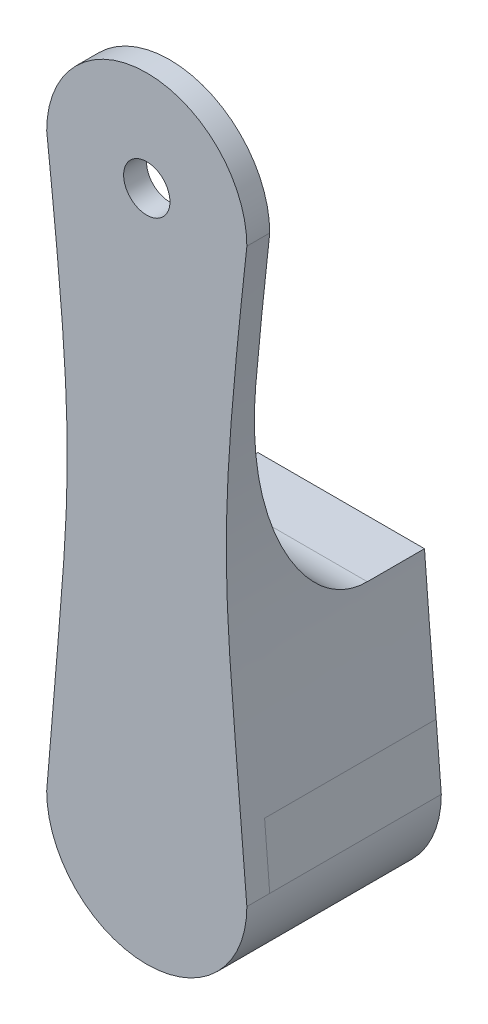
ISO-10303-21;
HEADER;
FILE_DESCRIPTION(('STEP AP214'),'2;1');
FILE_NAME('part.step','',(''),(''),'','','');
FILE_SCHEMA(('AUTOMOTIVE_DESIGN { 1 0 10303 214 1 1 1 1 }'));
ENDSEC;
DATA;
#1=APPLICATION_CONTEXT('core data for automotive mechanical design processes');
#2=APPLICATION_PROTOCOL_DEFINITION('international standard','automotive_design',2000,#1);
#3=PRODUCT_CONTEXT('',#1,'mechanical');
#4=PRODUCT('Part','Part','',(#3));
#5=PRODUCT_RELATED_PRODUCT_CATEGORY('part','',(#4));
#6=PRODUCT_DEFINITION_FORMATION('','',#4);
#7=PRODUCT_DEFINITION_CONTEXT('part definition',#1,'design');
#8=PRODUCT_DEFINITION('design','',#6,#7);
#9=PRODUCT_DEFINITION_SHAPE('','',#8);
#10=(LENGTH_UNIT() NAMED_UNIT(*) SI_UNIT(.MILLI.,.METRE.));
#11=(NAMED_UNIT(*) PLANE_ANGLE_UNIT() SI_UNIT($,.RADIAN.));
#12=(NAMED_UNIT(*) SI_UNIT($,.STERADIAN.) SOLID_ANGLE_UNIT());
#13=UNCERTAINTY_MEASURE_WITH_UNIT(LENGTH_MEASURE(1.E-05),#10,'distance_accuracy_value','');
#14=(GEOMETRIC_REPRESENTATION_CONTEXT(3) GLOBAL_UNCERTAINTY_ASSIGNED_CONTEXT((#13)) GLOBAL_UNIT_ASSIGNED_CONTEXT((#10,
#11,#12)) REPRESENTATION_CONTEXT('',''));
#15=CARTESIAN_POINT('',(0.,0.,0.));
#16=DIRECTION('',(0.,0.,1.));
#17=DIRECTION('',(1.,0.,0.));
#18=AXIS2_PLACEMENT_3D('',#15,#16,#17);
#19=CARTESIAN_POINT('',(-9.99999999999998,0.,4.));
#20=DIRECTION('',(1.,0.,0.));
#21=DIRECTION('',(0.,1.,0.));
#22=AXIS2_PLACEMENT_3D('',#19,#20,#21);
#23=PLANE('',#22);
#24=DIRECTION('',(0.,0.,-1.));
#25=VECTOR('',#24,1.);
#26=CARTESIAN_POINT('',(-9.99999999999999,-69.,4.));
#27=LINE('',#26,#25);
#28=CARTESIAN_POINT('',(-9.99999999999999,-69.,0.));
#29=VERTEX_POINT('',#28);
#30=CARTESIAN_POINT('',(-9.99999999999999,-69.,-30.));
#31=VERTEX_POINT('',#30);
#32=EDGE_CURVE('E171',#29,#31,#27,.T.);
#33=ORIENTED_EDGE('',*,*,#32,.F.);
#34=DIRECTION('',(0.,-1.,0.));
#35=VECTOR('',#34,1.);
#36=CARTESIAN_POINT('',(-9.99999999999999,-69.,0.));
#37=LINE('',#36,#35);
#38=CARTESIAN_POINT('',(-9.99999999999999,-110.,0.));
#39=VERTEX_POINT('',#38);
#40=EDGE_CURVE('E170',#29,#39,#37,.T.);
#41=ORIENTED_EDGE('',*,*,#40,.T.);
#42=DIRECTION('',(0.,0.,-1.));
#43=VECTOR('',#42,1.);
#44=CARTESIAN_POINT('',(-10.,-110.,4.));
#45=LINE('',#44,#43);
#46=CARTESIAN_POINT('',(-10.,-110.,-30.));
#47=VERTEX_POINT('',#46);
#48=EDGE_CURVE('E153',#39,#47,#45,.T.);
#49=ORIENTED_EDGE('',*,*,#48,.T.);
#50=DIRECTION('',(0.,-1.,0.));
#51=VECTOR('',#50,1.);
#52=CARTESIAN_POINT('',(-9.99999999999998,0.,-30.));
#53=LINE('',#52,#51);
#54=EDGE_CURVE('E192',#31,#47,#53,.T.);
#55=ORIENTED_EDGE('',*,*,#54,.F.);
#56=EDGE_LOOP('',(#33,#41,#49,#55));
#57=FACE_BOUND('',#56,.T.);
#58=ADVANCED_FACE('F45',(#57),#23,.T.);
#59=CARTESIAN_POINT('',(0.,-69.,4.));
#60=DIRECTION('',(0.,-1.,0.));
#61=DIRECTION('',(0.,0.,-1.));
#62=AXIS2_PLACEMENT_3D('',#59,#60,#61);
#63=PLANE('',#62);
#64=DIRECTION('',(0.,0.,-1.));
#65=VECTOR('',#64,1.);
#66=CARTESIAN_POINT('',(10.,-69.,4.));
#67=LINE('',#66,#65);
#68=CARTESIAN_POINT('',(10.,-69.,0.));
#69=VERTEX_POINT('',#68);
#70=CARTESIAN_POINT('',(10.,-69.,-30.));
#71=VERTEX_POINT('',#70);
#72=EDGE_CURVE('E488',#69,#71,#67,.T.);
#73=ORIENTED_EDGE('',*,*,#72,.F.);
#74=DIRECTION('',(-1.,0.,0.));
#75=VECTOR('',#74,1.);
#76=CARTESIAN_POINT('',(-9.99999999999999,-69.,0.));
#77=LINE('',#76,#75);
#78=EDGE_CURVE('E182',#69,#29,#77,.T.);
#79=ORIENTED_EDGE('',*,*,#78,.T.);
#80=ORIENTED_EDGE('',*,*,#32,.T.);
#81=DIRECTION('',(-1.,0.,0.));
#82=VECTOR('',#81,1.);
#83=CARTESIAN_POINT('',(0.,-69.,-30.));
#84=LINE('',#83,#82);
#85=EDGE_CURVE('E188',#71,#31,#84,.T.);
#86=ORIENTED_EDGE('',*,*,#85,.F.);
#87=EDGE_LOOP('',(#73,#79,#80,#86));
#88=FACE_BOUND('',#87,.T.);
#89=ADVANCED_FACE('F498',(#88),#63,.T.);
#90=CARTESIAN_POINT('',(10.,0.,4.));
#91=DIRECTION('',(1.,0.,0.));
#92=DIRECTION('',(0.,0.,-1.));
#93=AXIS2_PLACEMENT_3D('',#90,#91,#92);
#94=PLANE('',#93);
#95=DIRECTION('',(0.,1.,0.));
#96=VECTOR('',#95,1.);
#97=CARTESIAN_POINT('',(10.,-69.,0.));
#98=LINE('',#97,#96);
#99=CARTESIAN_POINT('',(10.,-110.,0.));
#100=VERTEX_POINT('',#99);
#101=EDGE_CURVE('E178',#100,#69,#98,.T.);
#102=ORIENTED_EDGE('',*,*,#101,.T.);
#103=ORIENTED_EDGE('',*,*,#72,.T.);
#104=DIRECTION('',(0.,1.,0.));
#105=VECTOR('',#104,1.);
#106=CARTESIAN_POINT('',(10.,0.,-30.));
#107=LINE('',#106,#105);
#108=CARTESIAN_POINT('',(10.,-110.,-30.));
#109=VERTEX_POINT('',#108);
#110=EDGE_CURVE('E198',#109,#71,#107,.T.);
#111=ORIENTED_EDGE('',*,*,#110,.F.);
#112=DIRECTION('',(0.,0.,-1.));
#113=VECTOR('',#112,1.);
#114=CARTESIAN_POINT('',(10.,-110.,4.));
#115=LINE('',#114,#113);
#116=EDGE_CURVE('E165',#100,#109,#115,.T.);
#117=ORIENTED_EDGE('',*,*,#116,.F.);
#118=EDGE_LOOP('',(#102,#103,#111,#117));
#119=FACE_BOUND('',#118,.T.);
#120=ADVANCED_FACE('F495',(#119),#94,.F.);
#121=CARTESIAN_POINT('',(0.,-110.,4.));
#122=DIRECTION('',(0.,-1.,0.));
#123=DIRECTION('',(0.,0.,-1.));
#124=AXIS2_PLACEMENT_3D('',#121,#122,#123);
#125=PLANE('',#124);
#126=DIRECTION('',(1.,0.,0.));
#127=VECTOR('',#126,1.);
#128=CARTESIAN_POINT('',(-9.99999999999999,-110.,0.));
#129=LINE('',#128,#127);
#130=EDGE_CURVE('E157',#39,#100,#129,.T.);
#131=ORIENTED_EDGE('',*,*,#130,.T.);
#132=ORIENTED_EDGE('',*,*,#116,.T.);
#133=DIRECTION('',(1.,0.,0.));
#134=VECTOR('',#133,1.);
#135=CARTESIAN_POINT('',(0.,-110.,-30.));
#136=LINE('',#135,#134);
#137=EDGE_CURVE('E160',#47,#109,#136,.T.);
#138=ORIENTED_EDGE('',*,*,#137,.F.);
#139=ORIENTED_EDGE('',*,*,#48,.F.);
#140=EDGE_LOOP('',(#131,#132,#138,#139));
#141=FACE_BOUND('',#140,.T.);
#142=ADVANCED_FACE('F155',(#141),#125,.F.);
#143=CARTESIAN_POINT('',(0.,0.,4.));
#144=DIRECTION('',(0.,0.,-1.));
#145=DIRECTION('',(-1.,0.,0.));
#146=AXIS2_PLACEMENT_3D('',#143,#144,#145);
#147=CYLINDRICAL_SURFACE('',#146,17.5);
#148=CARTESIAN_POINT('',(0.,0.,0.));
#149=DIRECTION('',(0.,0.,1.));
#150=DIRECTION('',(1.,0.,0.));
#151=AXIS2_PLACEMENT_3D('',#148,#149,#150);
#152=CIRCLE('',#151,17.5);
#153=CARTESIAN_POINT('',(17.5,0.,0.));
#154=VERTEX_POINT('',#153);
#155=CARTESIAN_POINT('',(-17.5,0.,0.));
#156=VERTEX_POINT('',#155);
#157=EDGE_CURVE('E395',#154,#156,#152,.T.);
#158=ORIENTED_EDGE('',*,*,#157,.T.);
#159=DIRECTION('',(0.,0.,-1.));
#160=VECTOR('',#159,1.);
#161=CARTESIAN_POINT('',(-17.5,0.,4.));
#162=LINE('',#161,#160);
#163=CARTESIAN_POINT('',(-17.5,0.,4.));
#164=VERTEX_POINT('',#163);
#165=EDGE_CURVE('E166',#164,#156,#162,.T.);
#166=ORIENTED_EDGE('',*,*,#165,.F.);
#167=CARTESIAN_POINT('',(0.,0.,4.));
#168=DIRECTION('',(0.,0.,1.));
#169=DIRECTION('',(1.,0.,0.));
#170=AXIS2_PLACEMENT_3D('',#167,#168,#169);
#171=CIRCLE('',#170,17.5);
#172=CARTESIAN_POINT('',(17.5,0.,4.));
#173=VERTEX_POINT('',#172);
#174=EDGE_CURVE('E322',#173,#164,#171,.T.);
#175=ORIENTED_EDGE('',*,*,#174,.F.);
#176=DIRECTION('',(0.,0.,-1.));
#177=VECTOR('',#176,1.);
#178=CARTESIAN_POINT('',(17.5,0.,4.));
#179=LINE('',#178,#177);
#180=EDGE_CURVE('E388',#173,#154,#179,.T.);
#181=ORIENTED_EDGE('',*,*,#180,.T.);
#182=EDGE_LOOP('',(#158,#166,#175,#181));
#183=FACE_BOUND('',#182,.T.);
#184=ADVANCED_FACE('F345',(#183),#147,.T.);
#185=CARTESIAN_POINT('',(-17.5,-100.,4.));
#186=CARTESIAN_POINT('',(-13.5912989078828,-51.1135752743678,4.));
#187=CARTESIAN_POINT('',(-11.8904555593686,-50.908982293762,4.));
#188=CARTESIAN_POINT('',(-17.5,0.,4.));
#189=B_SPLINE_CURVE_WITH_KNOTS('',3,(#185,#186,#187,#188),.UNSPECIFIED.,.F.,.F.,(4,4),(0.,1.),.UNSPECIFIED.);
#190=DIRECTION('',(0.,0.,-1.));
#191=VECTOR('',#190,1.);
#192=SURFACE_OF_LINEAR_EXTRUSION('',#189,#191);
#193=CARTESIAN_POINT('',(-16.5998418209988,-89.0672815160274,0.));
#194=CARTESIAN_POINT('',(-16.8837409539468,-92.4295025506724,0.));
#195=CARTESIAN_POINT('',(-17.1846865629044,-96.0563506279261,0.));
#196=CARTESIAN_POINT('',(-17.5,-100.,0.));
#197=B_SPLINE_CURVE_WITH_KNOTS('',3,(#193,#194,#195,#196),.UNSPECIFIED.,.F.,.F.,(4,4),(0.,
0.0806696213561753),.UNSPECIFIED.);
#198=CARTESIAN_POINT('',(-17.5,-100.,0.));
#199=VERTEX_POINT('',#198);
#200=CARTESIAN_POINT('',(-16.5998413522548,-89.0672759646865,0.));
#201=VERTEX_POINT('',#200);
#202=EDGE_CURVE('E187',#199,#201,#197,.F.);
#203=ORIENTED_EDGE('',*,*,#202,.F.);
#204=DIRECTION('',(0.,0.,-1.));
#205=VECTOR('',#204,1.);
#206=CARTESIAN_POINT('',(-17.5,-100.,4.));
#207=LINE('',#206,#205);
#208=CARTESIAN_POINT('',(-17.5,-100.,4.));
#209=VERTEX_POINT('',#208);
#210=EDGE_CURVE('E428',#209,#199,#207,.T.);
#211=ORIENTED_EDGE('',*,*,#210,.F.);
#212=EDGE_CURVE('E326',#209,#164,#189,.T.);
#213=ORIENTED_EDGE('',*,*,#212,.T.);
#214=ORIENTED_EDGE('',*,*,#165,.T.);
#215=CARTESIAN_POINT('',(-17.5,-100.,0.));
#216=CARTESIAN_POINT('',(-13.5912989078828,-51.1135752743678,0.));
#217=CARTESIAN_POINT('',(-11.8904555593686,-50.908982293762,0.));
#218=CARTESIAN_POINT('',(-17.5,0.,0.));
#219=B_SPLINE_CURVE_WITH_KNOTS('',3,(#215,#216,#217,#218),.UNSPECIFIED.,.F.,.F.,(4,4),(0.,1.),.UNSPECIFIED.);
#220=CARTESIAN_POINT('',(-15.0534282230224,-24.276893588505,0.));
#221=VERTEX_POINT('',#220);
#222=EDGE_CURVE('E399',#221,#156,#219,.T.);
#223=ORIENTED_EDGE('',*,*,#222,.F.);
#224=CARTESIAN_POINT('',(-15.0534282230119,-24.2768935886278,0.));
#225=CARTESIAN_POINT('',(-14.9839059410241,-25.0904078015407,-2.0760285242779E-06));
#226=CARTESIAN_POINT('',(-14.9162832548968,-25.90411240882,-0.0121000883236761));
#227=CARTESIAN_POINT('',(-14.7861541651748,-27.523665931671,-0.0609522984130274));
#228=CARTESIAN_POINT('',(-14.7236065157195,-28.3295184314627,-0.0974792798300322));
#229=CARTESIAN_POINT('',(-14.6041649105656,-29.9330819059297,-0.195203907458466));
#230=CARTESIAN_POINT('',(-14.5472265130482,-30.7308027311707,-0.256184215603709));
#231=CARTESIAN_POINT('',(-14.4395476557247,-32.3182779862367,-0.402755150597738));
#232=CARTESIAN_POINT('',(-14.3887634453189,-33.1080469348553,-0.488155527870269));
#233=CARTESIAN_POINT('',(-14.2939203472974,-34.680262357042,-0.683718043868205));
#234=CARTESIAN_POINT('',(-14.2498243012521,-35.4627247746911,-0.793734279161844));
#235=CARTESIAN_POINT('',(-14.1644289953766,-37.1070632058179,-1.05117326307564));
#236=CARTESIAN_POINT('',(-14.1239229512781,-37.9685561002311,-1.20132645743335));
#237=CARTESIAN_POINT('',(-14.0543278192777,-39.6423613712253,-1.52601824362099));
#238=CARTESIAN_POINT('',(-14.0247662785603,-40.4549644751605,-1.69894677515615));
#239=CARTESIAN_POINT('',(-13.9760296900614,-42.0380488140005,-2.0691344476941));
#240=CARTESIAN_POINT('',(-13.9564620344358,-42.808836486711,-2.26502438729344));
#241=CARTESIAN_POINT('',(-13.9267267634475,-44.3146192740848,-2.68086879406011));
#242=CARTESIAN_POINT('',(-13.9162496342468,-45.0499125196864,-2.89971985921821));
#243=CARTESIAN_POINT('',(-13.9037616629293,-46.4904509388263,-3.36102257045455));
#244=CARTESIAN_POINT('',(-13.9015215575921,-47.1959603913984,-3.6026399033508));
#245=CARTESIAN_POINT('',(-13.904064464187,-48.3327090964753,-4.01879695379935));
#246=CARTESIAN_POINT('',(-13.9065218539807,-48.7672536530287,-4.18436400031293));
#247=CARTESIAN_POINT('',(-13.9141517328653,-49.6164739840973,-4.52223382900899));
#248=CARTESIAN_POINT('',(-13.9192280994294,-50.0313196630723,-4.69411013771264));
#249=CARTESIAN_POINT('',(-13.9316931697181,-50.8422354267612,-5.04444174048949));
#250=CARTESIAN_POINT('',(-13.9390013357265,-51.2384774604979,-5.22250150625797));
#251=CARTESIAN_POINT('',(-13.9555541624198,-52.0130061947029,-5.58520839440873));
#252=CARTESIAN_POINT('',(-13.9647319371067,-52.3914691862095,-5.76948143552139));
#253=CARTESIAN_POINT('',(-13.9846751724584,-53.1310680420114,-6.14458694140756));
#254=CARTESIAN_POINT('',(-13.9953856366249,-53.4923852908148,-6.33506412411011));
#255=CARTESIAN_POINT('',(-14.0180706434806,-54.1981366126666,-6.72256431378357));
#256=CARTESIAN_POINT('',(-14.0300005739687,-54.5427586000039,-6.91924710407219));
#257=CARTESIAN_POINT('',(-14.0548248602575,-55.2154049335201,-7.31914608007545));
#258=CARTESIAN_POINT('',(-14.0676837211819,-55.543625165162,-7.52203437879963));
#259=CARTESIAN_POINT('',(-14.094088703554,-56.183612647071,-7.93433417001818));
#260=CARTESIAN_POINT('',(-14.1076074048774,-56.4955852810198,-8.1434280774686));
#261=CARTESIAN_POINT('',(-14.1350766172359,-57.1031086716391,-8.5681351109625));
#262=CARTESIAN_POINT('',(-14.1490069127158,-57.3988754717294,-8.78343969090319));
#263=CARTESIAN_POINT('',(-14.1770628324869,-57.9738966977746,-9.22054918829484));
#264=CARTESIAN_POINT('',(-14.1911747552797,-58.2533792899835,-9.44205486757463));
#265=CARTESIAN_POINT('',(-14.2228129896257,-58.8617210213102,-9.94630065887206));
#266=CARTESIAN_POINT('',(-14.2404183032825,-59.1882032941625,-10.2319315546138));
#267=CARTESIAN_POINT('',(-14.2666592698326,-59.6605703617769,-10.6708688291657));
#268=CARTESIAN_POINT('',(-14.2752658264647,-59.8132264744369,-10.816935164019));
#269=CARTESIAN_POINT('',(-14.292304518356,-60.111450504689,-11.111274533652));
#270=CARTESIAN_POINT('',(-14.3007371779907,-60.2570940094426,-11.2594707254322));
#271=CARTESIAN_POINT('',(-14.317385001935,-60.541209205963,-11.5580618851709));
#272=CARTESIAN_POINT('',(-14.3256014790832,-60.6797587481436,-11.7083826539196));
#273=CARTESIAN_POINT('',(-14.3417768472552,-60.949604596574,-12.0112221016218));
#274=CARTESIAN_POINT('',(-14.3497377570867,-61.0809804101513,-12.1636697362561));
#275=CARTESIAN_POINT('',(-14.3653645452887,-61.3363941195301,-12.4707591494594));
#276=CARTESIAN_POINT('',(-14.3730330574127,-61.4605124935226,-12.6253337769174));
#277=CARTESIAN_POINT('',(-14.3880400867778,-61.7013238626869,-12.9366740040373));
#278=CARTESIAN_POINT('',(-14.3953817479409,-61.8180974197644,-13.0933770719511));
#279=CARTESIAN_POINT('',(-14.409703251836,-62.0441408984792,-13.4089670260601));
#280=CARTESIAN_POINT('',(-14.4166866172703,-62.1534902051385,-13.5677967966272));
#281=CARTESIAN_POINT('',(-14.4302601555367,-62.3645770622132,-13.8876433734638));
#282=CARTESIAN_POINT('',(-14.4368541152608,-62.4663918524642,-14.0486090530375));
#283=CARTESIAN_POINT('',(-14.4505566274209,-62.6766788097836,-14.3962596591002));
#284=CARTESIAN_POINT('',(-14.4576163745181,-62.7842254272037,-14.583509552378));
#285=CARTESIAN_POINT('',(-14.4677692136564,-62.9379572921196,-14.8667188825352));
#286=CARTESIAN_POINT('',(-14.4710579930092,-62.9875974571332,-14.9608083840882));
#287=CARTESIAN_POINT('',(-14.477470373368,-63.0841091950243,-15.14931742265));
#288=CARTESIAN_POINT('',(-14.480595209101,-63.1310019213151,-15.2437260880004));
#289=CARTESIAN_POINT('',(-14.4896776052432,-63.2669384404242,-15.526263745104));
#290=CARTESIAN_POINT('',(-14.4954284934993,-63.3525318780297,-15.7160773686867));
#291=CARTESIAN_POINT('',(-14.5062162741443,-63.5123982630144,-16.0970499488945));
#292=CARTESIAN_POINT('',(-14.5112626730088,-63.5868232221344,-16.2881448335977));
#293=CARTESIAN_POINT('',(-14.5206156681683,-63.7242721793255,-16.671673251736));
#294=CARTESIAN_POINT('',(-14.5249308736483,-63.787429395186,-16.8640586824402));
#295=CARTESIAN_POINT('',(-14.5327999830646,-63.9022746651567,-17.2501485242306));
#296=CARTESIAN_POINT('',(-14.5363610768831,-63.9540712219818,-17.4438204427345));
#297=CARTESIAN_POINT('',(-14.5427052095842,-64.0461482535887,-17.832467519725));
#298=CARTESIAN_POINT('',(-14.54549352565,-64.0865068813396,-18.027424036419));
#299=CARTESIAN_POINT('',(-14.5502802094919,-64.1556847931729,-18.418625762237));
#300=CARTESIAN_POINT('',(-14.5522815281424,-64.1845471881409,-18.6148632975543));
#301=CARTESIAN_POINT('',(-14.5554857116988,-64.2307172615319,-19.0086155359051));
#302=CARTESIAN_POINT('',(-14.5566889127275,-64.2480298041282,-19.2061296658749));
#303=CARTESIAN_POINT('',(-14.5582967032705,-64.2711510812356,-19.6024290333916));
#304=CARTESIAN_POINT('',(-14.5586988837506,-64.2769251143581,-19.8012163068855));
#305=CARTESIAN_POINT('',(-14.5586961686669,-64.276893588519,-20.));
#306=B_SPLINE_CURVE_WITH_KNOTS('',3,(#224,#225,#226,#227,#228,#229,#230,#231,#232,#233,#234,
#235,#236,#237,#238,#239,#240,#241,#242,#243,#244,#245,#246,#247,#248,#249,#250,#251,#252,#253,
#254,#255,#256,#257,#258,#259,#260,#261,#262,#263,#264,#265,#266,#267,#268,#269,#270,#271,#272,
#273,#274,#275,#276,#277,#278,#279,#280,#281,#282,#283,#284,#285,#286,#287,#288,#289,#290,#291,
#292,#293,#294,#295,#296,#297,#298,#299,#300,#301,#302,#303,#304,#305),.UNSPECIFIED.,.F.,.F.,(4,
2,2,2,2,2,2,2,2,2,2,2,2,2,2,2,2,2,2,2,2,2,2,2,2,2,2,2,2,2,2,2,2,2,2,2,2,2,2,2,4),(0.,
2.44938800768197,4.87630509987086,7.28211390604919,9.66966787127433,12.0434285100718,
14.6690604378067,17.1623855556674,19.5482916788206,21.8493573716533,24.0858701985032,
25.4807724324656,26.8277794431249,28.1309960598937,29.3939048677394,30.6194554040991,
31.8101520521908,32.9681404276512,34.0952920566869,35.1932871091303,36.2636948576729,
37.5653505830385,38.1996351113774,38.8233939560641,39.437075874665,40.0411687849366,
40.6362058160897,41.222770600075,41.8015016457298,42.3730956263458,43.0209901855282,
43.340258996371,43.6566104791948,44.2812135882122,44.8963430841942,45.503632640775,
46.1048417550803,46.7018380359731,47.2965740133277,47.8910593616612,48.4873299150937),.UNSPECIFIED.);
#307=CARTESIAN_POINT('',(-14.5586961685227,-64.276893586447,-20.));
#308=VERTEX_POINT('',#307);
#309=EDGE_CURVE('E60',#221,#308,#306,.T.);
#310=ORIENTED_EDGE('',*,*,#309,.T.);
#311=DIRECTION('',(0.,0.,1.));
#312=VECTOR('',#311,1.);
#313=CARTESIAN_POINT('',(-14.5586961685227,-64.276893586447,-30.));
#314=LINE('',#313,#312);
#315=CARTESIAN_POINT('',(-14.5586961685227,-64.276893586447,-30.));
#316=VERTEX_POINT('',#315);
#317=EDGE_CURVE('E243',#316,#308,#314,.T.);
#318=ORIENTED_EDGE('',*,*,#317,.F.);
#319=CARTESIAN_POINT('',(-17.5,-100.,-30.));
#320=CARTESIAN_POINT('',(-13.5912989078828,-51.1135752743678,-30.));
#321=CARTESIAN_POINT('',(-11.8904555593686,-50.908982293762,-30.));
#322=CARTESIAN_POINT('',(-17.5,0.,-30.));
#323=B_SPLINE_CURVE_WITH_KNOTS('',3,(#319,#320,#321,#322),.UNSPECIFIED.,.F.,.F.,(4,4),(0.,1.),.UNSPECIFIED.);
#324=CARTESIAN_POINT('',(-16.5998413522548,-89.0672759646865,-30.));
#325=VERTEX_POINT('',#324);
#326=EDGE_CURVE('E209',#325,#316,#323,.T.);
#327=ORIENTED_EDGE('',*,*,#326,.F.);
#328=DIRECTION('',(0.,0.,1.));
#329=VECTOR('',#328,1.);
#330=CARTESIAN_POINT('',(-16.5998413522548,-89.0672759646865,-30.));
#331=LINE('',#330,#329);
#332=EDGE_CURVE('E250',#325,#201,#331,.T.);
#333=ORIENTED_EDGE('',*,*,#332,.T.);
#334=EDGE_LOOP('',(#203,#211,#213,#214,#223,#310,#318,#327,#333));
#335=FACE_BOUND('',#334,.T.);
#336=ADVANCED_FACE('F339',(#335),#192,.T.);
#337=CARTESIAN_POINT('',(0.,-100.,4.));
#338=DIRECTION('',(0.,0.,-1.));
#339=DIRECTION('',(-1.,0.,0.));
#340=AXIS2_PLACEMENT_3D('',#337,#338,#339);
#341=CYLINDRICAL_SURFACE('',#340,17.5);
#342=ORIENTED_EDGE('',*,*,#210,.T.);
#343=DIRECTION('',(0.,0.,1.));
#344=VECTOR('',#343,1.);
#345=CARTESIAN_POINT('',(-17.5,-100.,-30.));
#346=LINE('',#345,#344);
#347=CARTESIAN_POINT('',(-17.5,-100.,-30.));
#348=VERTEX_POINT('',#347);
#349=EDGE_CURVE('E280',#348,#199,#346,.T.);
#350=ORIENTED_EDGE('',*,*,#349,.F.);
#351=CARTESIAN_POINT('',(0.,-100.,-30.));
#352=DIRECTION('',(0.,0.,-1.));
#353=DIRECTION('',(-1.,0.,0.));
#354=AXIS2_PLACEMENT_3D('',#351,#352,#353);
#355=CIRCLE('',#354,17.5);
#356=CARTESIAN_POINT('',(17.5,-100.,-30.));
#357=VERTEX_POINT('',#356);
#358=EDGE_CURVE('E202',#357,#348,#355,.T.);
#359=ORIENTED_EDGE('',*,*,#358,.F.);
#360=DIRECTION('',(0.,0.,1.));
#361=VECTOR('',#360,1.);
#362=CARTESIAN_POINT('',(17.5,-100.,-30.));
#363=LINE('',#362,#361);
#364=CARTESIAN_POINT('',(17.5,-100.,0.));
#365=VERTEX_POINT('',#364);
#366=EDGE_CURVE('E233',#357,#365,#363,.T.);
#367=ORIENTED_EDGE('',*,*,#366,.T.);
#368=DIRECTION('',(0.,0.,-1.));
#369=VECTOR('',#368,1.);
#370=CARTESIAN_POINT('',(17.5,-100.,4.));
#371=LINE('',#370,#369);
#372=CARTESIAN_POINT('',(17.5,-100.,4.));
#373=VERTEX_POINT('',#372);
#374=EDGE_CURVE('E434',#373,#365,#371,.T.);
#375=ORIENTED_EDGE('',*,*,#374,.F.);
#376=CARTESIAN_POINT('',(0.,-100.,4.));
#377=DIRECTION('',(0.,0.,1.));
#378=DIRECTION('',(1.,0.,0.));
#379=AXIS2_PLACEMENT_3D('',#376,#377,#378);
#380=CIRCLE('',#379,17.5);
#381=EDGE_CURVE('E333',#209,#373,#380,.T.);
#382=ORIENTED_EDGE('',*,*,#381,.F.);
#383=EDGE_LOOP('',(#342,#350,#359,#367,#375,#382));
#384=FACE_BOUND('',#383,.T.);
#385=ADVANCED_FACE('F344',(#384),#341,.T.);
#386=CARTESIAN_POINT('',(17.5,-100.,4.));
#387=CARTESIAN_POINT('',(13.5912989078828,-51.1135752743678,4.));
#388=CARTESIAN_POINT('',(11.8904555593686,-50.908982293762,4.));
#389=CARTESIAN_POINT('',(17.5,0.,4.));
#390=B_SPLINE_CURVE_WITH_KNOTS('',3,(#386,#387,#388,#389),.UNSPECIFIED.,.F.,.F.,(4,4),(0.,1.),.UNSPECIFIED.);
#391=DIRECTION('',(0.,0.,-1.));
#392=VECTOR('',#391,1.);
#393=SURFACE_OF_LINEAR_EXTRUSION('',#390,#392);
#394=CARTESIAN_POINT('',(17.5,-100.,0.));
#395=CARTESIAN_POINT('',(17.1846865629043,-96.0563506279243,0.));
#396=CARTESIAN_POINT('',(16.8837409539465,-92.4295025506691,0.));
#397=CARTESIAN_POINT('',(16.5998418209984,-89.0672815160229,0.));
#398=B_SPLINE_CURVE_WITH_KNOTS('',3,(#394,#395,#396,#397),.UNSPECIFIED.,.F.,.F.,(4,4),(0.,
0.0806696213562109),.UNSPECIFIED.);
#399=CARTESIAN_POINT('',(16.5998418209984,-89.0672815160229,0.));
#400=VERTEX_POINT('',#399);
#401=EDGE_CURVE('E193',#365,#400,#398,.T.);
#402=ORIENTED_EDGE('',*,*,#401,.T.);
#403=DIRECTION('',(0.,0.,1.));
#404=VECTOR('',#403,1.);
#405=CARTESIAN_POINT('',(16.5998413522545,-89.0672759646832,-30.));
#406=LINE('',#405,#404);
#407=CARTESIAN_POINT('',(16.5998413522545,-89.0672759646832,-30.));
#408=VERTEX_POINT('',#407);
#409=EDGE_CURVE('E244',#408,#400,#406,.T.);
#410=ORIENTED_EDGE('',*,*,#409,.F.);
#411=CARTESIAN_POINT('',(17.5,0.,-30.));
#412=CARTESIAN_POINT('',(11.8904555593686,-50.908982293762,-30.));
#413=CARTESIAN_POINT('',(13.5912989078828,-51.1135752743678,-30.));
#414=CARTESIAN_POINT('',(17.5,-100.,-30.));
#415=B_SPLINE_CURVE_WITH_KNOTS('',3,(#411,#412,#413,#414),.UNSPECIFIED.,.F.,.F.,(4,4),(0.,1.),.UNSPECIFIED.);
#416=CARTESIAN_POINT('',(14.5586961685227,-64.276893586447,-30.));
#417=VERTEX_POINT('',#416);
#418=EDGE_CURVE('E221',#417,#408,#415,.T.);
#419=ORIENTED_EDGE('',*,*,#418,.F.);
#420=DIRECTION('',(0.,0.,1.));
#421=VECTOR('',#420,1.);
#422=CARTESIAN_POINT('',(14.5586961685227,-64.276893586447,-30.));
#423=LINE('',#422,#421);
#424=CARTESIAN_POINT('',(14.5586961685227,-64.276893586447,-20.));
#425=VERTEX_POINT('',#424);
#426=EDGE_CURVE('E239',#417,#425,#423,.T.);
#427=ORIENTED_EDGE('',*,*,#426,.T.);
#428=CARTESIAN_POINT('',(14.5586961685787,-64.2768935872509,-20.));
#429=CARTESIAN_POINT('',(14.5586988731491,-64.276924991348,-19.8014142297989));
#430=CARTESIAN_POINT('',(14.558297475492,-64.2711621828851,-19.6028248953901));
#431=CARTESIAN_POINT('',(14.5566928117308,-64.2480858899734,-19.2069177949689));
#432=CARTESIAN_POINT('',(14.5554919457581,-64.2308069785304,-19.009598002485));
#433=CARTESIAN_POINT('',(14.5522939714797,-64.1847265924715,-18.6162308237667));
#434=CARTESIAN_POINT('',(14.5502965287094,-64.1559202777425,-18.4201840072106));
#435=CARTESIAN_POINT('',(14.5455190824763,-64.0868765963588,-18.0293601171713));
#436=CARTESIAN_POINT('',(14.5427361395931,-64.0465962875495,-17.8345906799768));
#437=CARTESIAN_POINT('',(14.5364041751601,-63.9546976088522,-17.4463141966651));
#438=CARTESIAN_POINT('',(14.5328498960358,-63.9030013811746,-17.2528257035827));
#439=CARTESIAN_POINT('',(14.52499575873,-63.7883780841298,-16.8670992017966));
#440=CARTESIAN_POINT('',(14.520688736153,-63.7253429079098,-16.6748935348643));
#441=CARTESIAN_POINT('',(14.5113533563297,-63.5881589204214,-16.2917211912914));
#442=CARTESIAN_POINT('',(14.5063164186713,-63.5138773584681,-16.1008024006091));
#443=CARTESIAN_POINT('',(14.4955487039328,-63.3543182414904,-15.7201786416446));
#444=CARTESIAN_POINT('',(14.4898084498502,-63.2688891840511,-15.5305374660631));
#445=CARTESIAN_POINT('',(14.4807426302178,-63.1332120974295,-15.2482528134618));
#446=CARTESIAN_POINT('',(14.4776234965353,-63.0864091195218,-15.1539290036828));
#447=CARTESIAN_POINT('',(14.4712227629021,-62.9900819047821,-14.9655888190824));
#448=CARTESIAN_POINT('',(14.4679399314932,-62.9405365801054,-14.8715832712483));
#449=CARTESIAN_POINT('',(14.457805434519,-62.7870992154987,-14.588627858519));
#450=CARTESIAN_POINT('',(14.4507582737171,-62.6797575557707,-14.4015431412721));
#451=CARTESIAN_POINT('',(14.4370914232829,-62.4700472437166,-14.0544895658878));
#452=CARTESIAN_POINT('',(14.4305211351962,-62.3686146999728,-13.8939498679885));
#453=CARTESIAN_POINT('',(14.4169966021273,-62.1583312119328,-13.574942497881));
#454=CARTESIAN_POINT('',(14.4100385963657,-62.0494036546701,-13.4165254769019));
#455=CARTESIAN_POINT('',(14.3957691922067,-61.8242417037386,-13.1017484150926));
#456=CARTESIAN_POINT('',(14.3884542925661,-61.707928558351,-12.9454449591254));
#457=CARTESIAN_POINT('',(14.3735018694953,-61.4680753712083,-12.6348913821232));
#458=CARTESIAN_POINT('',(14.3658612175303,-61.3444553957404,-12.4807032150081));
#459=CARTESIAN_POINT('',(14.3502909069218,-61.0900751734717,-12.1743742012145));
#460=CARTESIAN_POINT('',(14.3423586224181,-60.9592350594346,-12.0222998912731));
#461=CARTESIAN_POINT('',(14.3262409093323,-60.6904966936637,-11.7201946073681));
#462=CARTESIAN_POINT('',(14.3180534612376,-60.5525195207134,-11.5702340357737));
#463=CARTESIAN_POINT('',(14.3014637187703,-60.2695846269771,-11.272350810918));
#464=CARTESIAN_POINT('',(14.2930601013417,-60.1245496125295,-11.1245016952918));
#465=CARTESIAN_POINT('',(14.2760791039053,-59.8275776247244,-10.8308440481613));
#466=CARTESIAN_POINT('',(14.2675011789611,-59.6755655877461,-10.6851116845401));
#467=CARTESIAN_POINT('',(14.2413462868977,-59.2052126653871,-10.2471776046679));
#468=CARTESIAN_POINT('',(14.2237955952704,-58.8801269074867,-9.96217349815793));
#469=CARTESIAN_POINT('',(14.1922554677711,-58.2745346417543,-9.45911622351253));
#470=CARTESIAN_POINT('',(14.1781885862278,-57.996403150934,-9.23818076291823));
#471=CARTESIAN_POINT('',(14.1502152677641,-57.4241757023737,-8.80217002677695));
#472=CARTESIAN_POINT('',(14.1363222418496,-57.1298531674329,-8.58739121631088));
#473=CARTESIAN_POINT('',(14.1089175119124,-56.525312408218,-8.16369373913142));
#474=CARTESIAN_POINT('',(14.0954256374022,-56.2148796448839,-7.95508070256293));
#475=CARTESIAN_POINT('',(14.0690614132697,-55.578070057341,-7.54370096015287));
#476=CARTESIAN_POINT('',(14.0562159866937,-55.2514892894207,-7.34124876010686));
#477=CARTESIAN_POINT('',(14.031402574421,-54.5822262484641,-6.94218045418457));
#478=CARTESIAN_POINT('',(14.0194694560975,-54.2393494914746,-6.74588893722304));
#479=CARTESIAN_POINT('',(13.9967587016049,-53.53720161031,-6.35913003831025));
#480=CARTESIAN_POINT('',(13.9860248953644,-53.1777439555516,-6.16899929583058));
#481=CARTESIAN_POINT('',(13.9660119372632,-52.4419886878098,-5.79454569505404));
#482=CARTESIAN_POINT('',(13.9567868153659,-52.0655110725702,-5.61057419075726));
#483=CARTESIAN_POINT('',(13.9401122818253,-51.2950920095695,-5.24842990420874));
#484=CARTESIAN_POINT('',(13.932728570822,-50.9009756590694,-5.0706268515364));
#485=CARTESIAN_POINT('',(13.920081114392,-50.0944685018446,-4.72076819554889));
#486=CARTESIAN_POINT('',(13.9148964642741,-49.6819071475148,-4.54910325431152));
#487=CARTESIAN_POINT('',(13.9070140605929,-48.8374340754941,-4.2116179900636));
#488=CARTESIAN_POINT('',(13.9044106882716,-48.4053538360488,-4.04621873140533));
#489=CARTESIAN_POINT('',(13.9014253768997,-47.2685966183287,-3.62801630501766));
#490=CARTESIAN_POINT('',(13.9034115184374,-46.5605220767186,-3.38438779212015));
#491=CARTESIAN_POINT('',(13.9154486282722,-45.1144789721195,-2.91925233674555));
#492=CARTESIAN_POINT('',(13.9257325207811,-44.3762399833859,-2.69859507207372));
#493=CARTESIAN_POINT('',(13.9551569556849,-42.8641061239205,-2.27932690724869));
#494=CARTESIAN_POINT('',(13.9746125595656,-42.0899060435175,-2.08184065623088));
#495=CARTESIAN_POINT('',(14.0232208839179,-40.4994307225501,-1.70864295332719));
#496=CARTESIAN_POINT('',(14.0527739483645,-39.6828417179461,-1.53432810956402));
#497=CARTESIAN_POINT('',(14.1224699450488,-38.0003643553334,-1.20703685361834));
#498=CARTESIAN_POINT('',(14.1630953489307,-37.1341783414393,-1.05570368431188));
#499=CARTESIAN_POINT('',(14.2486681067235,-35.4837293173537,-0.796781232175978));
#500=CARTESIAN_POINT('',(14.2927864223423,-34.6998671539547,-0.686341194261236));
#501=CARTESIAN_POINT('',(14.3877041518665,-33.1248129718447,-0.490026727131073));
#502=CARTESIAN_POINT('',(14.4385410037202,-32.3336048587837,-0.404299213301576));
#503=CARTESIAN_POINT('',(14.5463527461418,-30.7432030052272,-0.257165905689614));
#504=CARTESIAN_POINT('',(14.6033717670932,-29.9439945936998,-0.1959519051764));
#505=CARTESIAN_POINT('',(14.7229997046771,-28.3374013562906,-0.0978521073822135));
#506=CARTESIAN_POINT('',(14.7856534737214,-27.5300065676375,-0.0611855646910358));
#507=CARTESIAN_POINT('',(14.9160174826163,-25.907311023591,-0.0121458831169174));
#508=CARTESIAN_POINT('',(14.9837693634931,-25.0920066379071,-2.067401925975E-06));
#509=CARTESIAN_POINT('',(15.0534282230212,-24.276893588519,0.));
#510=B_SPLINE_CURVE_WITH_KNOTS('',3,(#428,#429,#430,#431,#432,#433,#434,#435,#436,#437,#438,
#439,#440,#441,#442,#443,#444,#445,#446,#447,#448,#449,#450,#451,#452,#453,#454,#455,#456,#457,
#458,#459,#460,#461,#462,#463,#464,#465,#466,#467,#468,#469,#470,#471,#472,#473,#474,#475,#476,
#477,#478,#479,#480,#481,#482,#483,#484,#485,#486,#487,#488,#489,#490,#491,#492,#493,#494,#495,
#496,#497,#498,#499,#500,#501,#502,#503,#504,#505,#506,#507,#508,#509),.UNSPECIFIED.,.F.,.F.,(4,
2,2,2,2,2,2,2,2,2,2,2,2,2,2,2,2,2,2,2,2,2,2,2,2,2,2,2,2,2,2,2,2,2,2,2,2,2,2,2,4),(0.,
0.59567701185861,1.18957372253683,1.78372005998633,2.38011992067055,2.98072032988712,
3.58738378951754,4.20186518192901,4.82579411897818,5.14179757049239,5.460710575978,
6.10786895312677,6.677769642082,7.25476282006895,7.83954031548006,8.43273635954841,
9.03493081121832,9.64665345413301,10.2683891992349,10.9005840383803,12.1978509232144,
13.2640201574064,14.3575857706503,15.4800996539112,16.6332206238073,17.8187935970657,
19.0389310079943,20.2960961438082,21.5931881650378,22.9336286139884,24.3214492139375,
26.5671839041546,28.8782467707592,31.2752313008996,33.7810981709623,36.4211983149386,
38.7992894788741,41.1912397771125,43.6015552198391,46.0331218519129,48.4873237860522),.UNSPECIFIED.);
#511=CARTESIAN_POINT('',(15.0534282230236,-24.2768935884908,0.));
#512=VERTEX_POINT('',#511);
#513=EDGE_CURVE('E12',#425,#512,#510,.T.);
#514=ORIENTED_EDGE('',*,*,#513,.T.);
#515=CARTESIAN_POINT('',(17.5,-100.,0.));
#516=CARTESIAN_POINT('',(13.5912989078828,-51.1135752743678,0.));
#517=CARTESIAN_POINT('',(11.8904555593686,-50.908982293762,0.));
#518=CARTESIAN_POINT('',(17.5,0.,0.));
#519=B_SPLINE_CURVE_WITH_KNOTS('',3,(#515,#516,#517,#518),.UNSPECIFIED.,.F.,.F.,(4,4),(0.,1.),.UNSPECIFIED.);
#520=EDGE_CURVE('E323',#512,#154,#519,.T.);
#521=ORIENTED_EDGE('',*,*,#520,.T.);
#522=ORIENTED_EDGE('',*,*,#180,.F.);
#523=EDGE_CURVE('E382',#373,#173,#390,.T.);
#524=ORIENTED_EDGE('',*,*,#523,.F.);
#525=ORIENTED_EDGE('',*,*,#374,.T.);
#526=EDGE_LOOP('',(#402,#410,#419,#427,#514,#521,#522,#524,#525));
#527=FACE_BOUND('',#526,.T.);
#528=ADVANCED_FACE('F369',(#527),#393,.F.);
#529=CARTESIAN_POINT('',(0.,0.,4.));
#530=DIRECTION('',(0.,0.,-1.));
#531=DIRECTION('',(-1.,0.,0.));
#532=AXIS2_PLACEMENT_3D('',#529,#530,#531);
#533=CYLINDRICAL_SURFACE('',#532,4.05);
#534=CARTESIAN_POINT('',(0.,0.,4.));
#535=DIRECTION('',(0.,0.,1.));
#536=DIRECTION('',(1.,0.,0.));
#537=AXIS2_PLACEMENT_3D('',#534,#535,#536);
#538=CIRCLE('',#537,4.05);
#539=CARTESIAN_POINT('',(4.05,0.,4.));
#540=VERTEX_POINT('',#539);
#541=EDGE_CURVE('E318',#540,#540,#538,.T.);
#542=ORIENTED_EDGE('',*,*,#541,.T.);
#543=EDGE_LOOP('',(#542));
#544=FACE_BOUND('',#543,.T.);
#545=CARTESIAN_POINT('',(0.,0.,0.));
#546=DIRECTION('',(0.,0.,1.));
#547=DIRECTION('',(1.,0.,0.));
#548=AXIS2_PLACEMENT_3D('',#545,#546,#547);
#549=CIRCLE('',#548,4.05);
#550=CARTESIAN_POINT('',(4.05,0.,0.));
#551=VERTEX_POINT('',#550);
#552=EDGE_CURVE('E289',#551,#551,#549,.T.);
#553=ORIENTED_EDGE('',*,*,#552,.F.);
#554=EDGE_LOOP('',(#553));
#555=FACE_BOUND('',#554,.T.);
#556=ADVANCED_FACE('F378',(#544,#555),#533,.F.);
#557=CARTESIAN_POINT('',(0.,0.,4.));
#558=DIRECTION('',(0.,0.,1.));
#559=DIRECTION('',(1.,0.,0.));
#560=AXIS2_PLACEMENT_3D('',#557,#558,#559);
#561=PLANE('',#560);
#562=ORIENTED_EDGE('',*,*,#541,.F.);
#563=EDGE_LOOP('',(#562));
#564=FACE_BOUND('',#563,.T.);
#565=ORIENTED_EDGE('',*,*,#174,.T.);
#566=ORIENTED_EDGE('',*,*,#212,.F.);
#567=ORIENTED_EDGE('',*,*,#381,.T.);
#568=ORIENTED_EDGE('',*,*,#523,.T.);
#569=EDGE_LOOP('',(#565,#566,#567,#568));
#570=FACE_BOUND('',#569,.T.);
#571=ADVANCED_FACE('F275',(#564,#570),#561,.T.);
#572=CARTESIAN_POINT('',(0.,0.,0.));
#573=DIRECTION('',(0.,0.,1.));
#574=DIRECTION('',(1.,0.,0.));
#575=AXIS2_PLACEMENT_3D('',#572,#573,#574);
#576=PLANE('',#575);
#577=ORIENTED_EDGE('',*,*,#552,.T.);
#578=EDGE_LOOP('',(#577));
#579=FACE_BOUND('',#578,.T.);
#580=ORIENTED_EDGE('',*,*,#520,.F.);
#581=CARTESIAN_POINT('',(-16.5587710453233,-24.2768935885189,0.));
#582=CARTESIAN_POINT('',(-5.5195903484411,-24.2768935885189,0.));
#583=CARTESIAN_POINT('',(5.51959034844112,-24.2768935885189,0.));
#584=CARTESIAN_POINT('',(16.5587710453233,-24.2768935885189,0.));
#585=(BOUNDED_CURVE() B_SPLINE_CURVE(3,(#581,#582,#583,#584),.UNSPECIFIED.,.F.,
.F.) B_SPLINE_CURVE_WITH_KNOTS((4,4),(-0.0165587710453233,0.0165587710453233),
.UNSPECIFIED.) CURVE() GEOMETRIC_REPRESENTATION_ITEM() RATIONAL_B_SPLINE_CURVE((1.,1.,1.,1.)) REPRESENTATION_ITEM(''));
#586=EDGE_CURVE('E416',#512,#221,#585,.F.);
#587=ORIENTED_EDGE('',*,*,#586,.T.);
#588=ORIENTED_EDGE('',*,*,#222,.T.);
#589=ORIENTED_EDGE('',*,*,#157,.F.);
#590=EDGE_LOOP('',(#580,#587,#588,#589));
#591=FACE_BOUND('',#590,.T.);
#592=ADVANCED_FACE('F273',(#579,#591),#576,.F.);
#593=CARTESIAN_POINT('',(-9.2039867242076,0.757821033356459,-30.));
#594=DIRECTION('',(0.996627514919153,-0.0820584944175412,0.));
#595=DIRECTION('',(0.0820584944175412,0.996627514919153,0.));
#596=AXIS2_PLACEMENT_3D('',#593,#594,#595);
#597=PLANE('',#596);
#598=ORIENTED_EDGE('',*,*,#202,.T.);
#599=ORIENTED_EDGE('',*,*,#332,.F.);
#600=DIRECTION('',(0.0820584944175412,0.996627514919153,0.));
#601=VECTOR('',#600,1.);
#602=CARTESIAN_POINT('',(-9.2039867242076,0.757821033356459,-30.));
#603=LINE('',#602,#601);
#604=EDGE_CURVE('E206',#348,#325,#603,.T.);
#605=ORIENTED_EDGE('',*,*,#604,.F.);
#606=ORIENTED_EDGE('',*,*,#349,.T.);
#607=EDGE_LOOP('',(#598,#599,#605,#606));
#608=FACE_BOUND('',#607,.T.);
#609=ADVANCED_FACE('F267',(#608),#597,.F.);
#610=CARTESIAN_POINT('',(0.,-64.2768935885189,-30.));
#611=DIRECTION('',(0.,1.,0.));
#612=DIRECTION('',(-1.,0.,0.));
#613=AXIS2_PLACEMENT_3D('',#610,#611,#612);
#614=PLANE('',#613);
#615=ORIENTED_EDGE('',*,*,#317,.T.);
#616=CARTESIAN_POINT('',(16.5587710453234,-64.2768935885189,-20.));
#617=CARTESIAN_POINT('',(5.51959034844115,-64.2768935885189,-20.));
#618=CARTESIAN_POINT('',(-5.51959034844109,-64.2768935885189,-20.));
#619=CARTESIAN_POINT('',(-16.5587710453233,-64.2768935885189,-20.));
#620=(BOUNDED_CURVE() B_SPLINE_CURVE(3,(#616,#617,#618,#619),.UNSPECIFIED.,.F.,
.F.) B_SPLINE_CURVE_WITH_KNOTS((4,4),(-0.0165587710453233,0.0165587710453233),
.UNSPECIFIED.) CURVE() GEOMETRIC_REPRESENTATION_ITEM() RATIONAL_B_SPLINE_CURVE((1.,1.,1.,1.)) REPRESENTATION_ITEM(''));
#621=EDGE_CURVE('E74',#308,#425,#620,.F.);
#622=ORIENTED_EDGE('',*,*,#621,.T.);
#623=ORIENTED_EDGE('',*,*,#426,.F.);
#624=DIRECTION('',(-1.,0.,0.));
#625=VECTOR('',#624,1.);
#626=CARTESIAN_POINT('',(0.,-64.2768935885189,-30.));
#627=LINE('',#626,#625);
#628=EDGE_CURVE('E214',#417,#316,#627,.T.);
#629=ORIENTED_EDGE('',*,*,#628,.T.);
#630=EDGE_LOOP('',(#615,#622,#623,#629));
#631=FACE_BOUND('',#630,.T.);
#632=ADVANCED_FACE('F256',(#631),#614,.T.);
#633=CARTESIAN_POINT('',(9.20398672420765,0.757821033356459,-30.));
#634=DIRECTION('',(0.996627514919153,0.0820584944175407,0.));
#635=DIRECTION('',(-0.0820584944175407,0.996627514919153,0.));
#636=AXIS2_PLACEMENT_3D('',#633,#634,#635);
#637=PLANE('',#636);
#638=ORIENTED_EDGE('',*,*,#401,.F.);
#639=ORIENTED_EDGE('',*,*,#366,.F.);
#640=DIRECTION('',(-0.0820584944175407,0.996627514919153,0.));
#641=VECTOR('',#640,1.);
#642=CARTESIAN_POINT('',(9.20398672420765,0.757821033356459,-30.));
#643=LINE('',#642,#641);
#644=EDGE_CURVE('E226',#357,#408,#643,.T.);
#645=ORIENTED_EDGE('',*,*,#644,.T.);
#646=ORIENTED_EDGE('',*,*,#409,.T.);
#647=EDGE_LOOP('',(#638,#639,#645,#646));
#648=FACE_BOUND('',#647,.T.);
#649=ADVANCED_FACE('F266',(#648),#637,.T.);
#650=CARTESIAN_POINT('',(0.,0.,-30.));
#651=DIRECTION('',(0.,0.,-1.));
#652=DIRECTION('',(-1.,0.,0.));
#653=AXIS2_PLACEMENT_3D('',#650,#651,#652);
#654=PLANE('',#653);
#655=ORIENTED_EDGE('',*,*,#85,.T.);
#656=ORIENTED_EDGE('',*,*,#54,.T.);
#657=ORIENTED_EDGE('',*,*,#137,.T.);
#658=ORIENTED_EDGE('',*,*,#110,.T.);
#659=EDGE_LOOP('',(#655,#656,#657,#658));
#660=FACE_BOUND('',#659,.T.);
#661=ORIENTED_EDGE('',*,*,#358,.T.);
#662=ORIENTED_EDGE('',*,*,#604,.T.);
#663=ORIENTED_EDGE('',*,*,#326,.T.);
#664=ORIENTED_EDGE('',*,*,#628,.F.);
#665=ORIENTED_EDGE('',*,*,#418,.T.);
#666=ORIENTED_EDGE('',*,*,#644,.F.);
#667=EDGE_LOOP('',(#661,#662,#663,#664,#665,#666));
#668=FACE_BOUND('',#667,.T.);
#669=ADVANCED_FACE('F457',(#660,#668),#654,.T.);
#670=CARTESIAN_POINT('',(0.,0.,0.));
#671=DIRECTION('',(0.,0.,1.));
#672=DIRECTION('',(1.,0.,0.));
#673=AXIS2_PLACEMENT_3D('',#670,#671,#672);
#674=PLANE('',#673);
#675=ORIENTED_EDGE('',*,*,#40,.F.);
#676=ORIENTED_EDGE('',*,*,#78,.F.);
#677=ORIENTED_EDGE('',*,*,#101,.F.);
#678=ORIENTED_EDGE('',*,*,#130,.F.);
#679=EDGE_LOOP('',(#675,#676,#677,#678));
#680=FACE_BOUND('',#679,.T.);
#681=ADVANCED_FACE('F177',(#680),#674,.F.);
#682=CARTESIAN_POINT('',(16.5587710453233,-24.2768935885189,0.));
#683=CARTESIAN_POINT('',(5.51959034844112,-24.2768935885189,0.));
#684=CARTESIAN_POINT('',(-5.5195903484411,-24.2768935885189,0.));
#685=CARTESIAN_POINT('',(-16.5587710453233,-24.2768935885189,0.));
#686=CARTESIAN_POINT('',(16.5587710453234,-64.2768935885189,0.));
#687=CARTESIAN_POINT('',(5.51959034844115,-64.2768935885189,0.));
#688=CARTESIAN_POINT('',(-5.51959034844109,-64.2768935885189,0.));
#689=CARTESIAN_POINT('',(-16.5587710453233,-64.2768935885189,0.));
#690=CARTESIAN_POINT('',(16.5587710453234,-64.2768935885189,-20.));
#691=CARTESIAN_POINT('',(5.51959034844115,-64.2768935885189,-20.));
#692=CARTESIAN_POINT('',(-5.51959034844109,-64.2768935885189,-20.));
#693=CARTESIAN_POINT('',(-16.5587710453233,-64.2768935885189,-20.));
#694=(BOUNDED_SURFACE() B_SPLINE_SURFACE(2,3,((#682,#683,#684,#685),(#686,#687,#688,#689),(#690,
#691,#692,#693)),.UNSPECIFIED.,.F.,.F.,.F.) B_SPLINE_SURFACE_WITH_KNOTS((3,3),(4,4),(0.,1.),
(-0.0165587710453233,0.0165587710453233),
.UNSPECIFIED.) GEOMETRIC_REPRESENTATION_ITEM() RATIONAL_B_SPLINE_SURFACE(((1.,1.,1.,1.),
(0.707106781186548,0.707106781186548,0.707106781186548,0.707106781186548),(1.,1.,1.,1.))) REPRESENTATION_ITEM('') SURFACE());
#695=ORIENTED_EDGE('',*,*,#513,.F.);
#696=ORIENTED_EDGE('',*,*,#621,.F.);
#697=ORIENTED_EDGE('',*,*,#309,.F.);
#698=ORIENTED_EDGE('',*,*,#586,.F.);
#699=EDGE_LOOP('',(#695,#696,#697,#698));
#700=FACE_BOUND('',#699,.T.);
#701=ADVANCED_FACE('F48',(#700),#694,.T.);
#702=CLOSED_SHELL('',(#58,#89,#120,#142,#184,#336,#385,#528,#556,#571,#592,#609,#632,#649,#669,
#681,#701));
#703=MANIFOLD_SOLID_BREP('B2',#702);
#704=ADVANCED_BREP_SHAPE_REPRESENTATION('',(#18,#703),#14);
#705=SHAPE_DEFINITION_REPRESENTATION(#9,#704);
ENDSEC;
END-ISO-10303-21;
